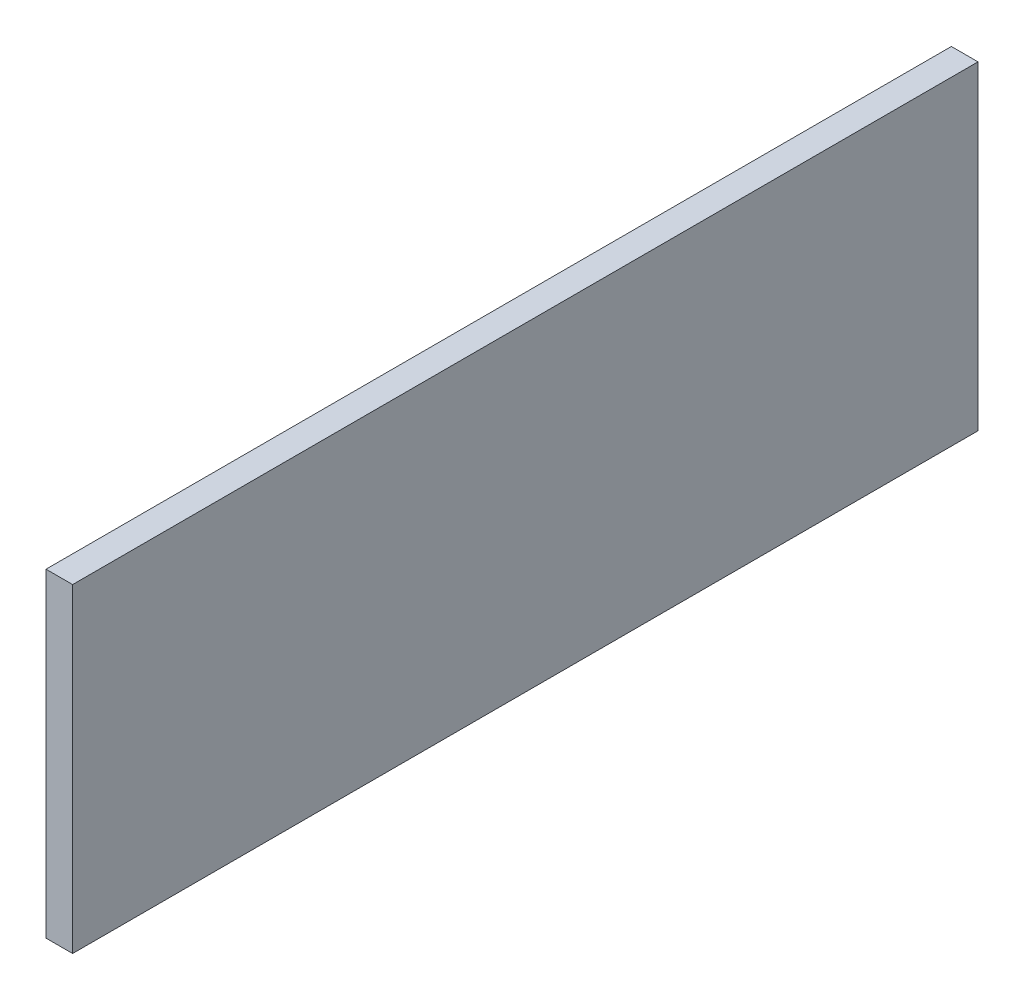
ISO-10303-21;
HEADER;
FILE_DESCRIPTION(('STEP AP214'),'2;1');
FILE_NAME('part.step','',(''),(''),'','','');
FILE_SCHEMA(('AUTOMOTIVE_DESIGN { 1 0 10303 214 1 1 1 1 }'));
ENDSEC;
DATA;
#1=APPLICATION_CONTEXT('core data for automotive mechanical design processes');
#2=APPLICATION_PROTOCOL_DEFINITION('international standard','automotive_design',2000,#1);
#3=PRODUCT_CONTEXT('',#1,'mechanical');
#4=PRODUCT('Part','Part','',(#3));
#5=PRODUCT_RELATED_PRODUCT_CATEGORY('part','',(#4));
#6=PRODUCT_DEFINITION_FORMATION('','',#4);
#7=PRODUCT_DEFINITION_CONTEXT('part definition',#1,'design');
#8=PRODUCT_DEFINITION('design','',#6,#7);
#9=PRODUCT_DEFINITION_SHAPE('','',#8);
#10=(LENGTH_UNIT() NAMED_UNIT(*) SI_UNIT(.MILLI.,.METRE.));
#11=(NAMED_UNIT(*) PLANE_ANGLE_UNIT() SI_UNIT($,.RADIAN.));
#12=(NAMED_UNIT(*) SI_UNIT($,.STERADIAN.) SOLID_ANGLE_UNIT());
#13=UNCERTAINTY_MEASURE_WITH_UNIT(LENGTH_MEASURE(1.E-05),#10,'distance_accuracy_value','');
#14=(GEOMETRIC_REPRESENTATION_CONTEXT(3) GLOBAL_UNCERTAINTY_ASSIGNED_CONTEXT((#13)) GLOBAL_UNIT_ASSIGNED_CONTEXT((#10,
#11,#12)) REPRESENTATION_CONTEXT('',''));
#15=CARTESIAN_POINT('',(0.,0.,0.));
#16=DIRECTION('',(0.,0.,1.));
#17=DIRECTION('',(1.,0.,0.));
#18=AXIS2_PLACEMENT_3D('',#15,#16,#17);
#19=CARTESIAN_POINT('',(19.05,0.,0.));
#20=DIRECTION('',(0.,0.,-1.));
#21=DIRECTION('',(0.,1.,0.));
#22=AXIS2_PLACEMENT_3D('',#19,#20,#21);
#23=PLANE('',#22);
#24=DIRECTION('',(0.,-1.,0.));
#25=VECTOR('',#24,1.);
#26=CARTESIAN_POINT('',(0.,0.,0.));
#27=LINE('',#26,#25);
#28=CARTESIAN_POINT('',(0.,0.,0.));
#29=VERTEX_POINT('',#28);
#30=CARTESIAN_POINT('',(0.,-228.6,0.));
#31=VERTEX_POINT('',#30);
#32=EDGE_CURVE('E98',#29,#31,#27,.T.);
#33=ORIENTED_EDGE('',*,*,#32,.T.);
#34=DIRECTION('',(-1.,0.,0.));
#35=VECTOR('',#34,1.);
#36=CARTESIAN_POINT('',(19.05,-228.6,0.));
#37=LINE('',#36,#35);
#38=CARTESIAN_POINT('',(19.05,-228.6,0.));
#39=VERTEX_POINT('',#38);
#40=EDGE_CURVE('E11',#39,#31,#37,.T.);
#41=ORIENTED_EDGE('',*,*,#40,.F.);
#42=DIRECTION('',(0.,-1.,0.));
#43=VECTOR('',#42,1.);
#44=CARTESIAN_POINT('',(19.05,0.,0.));
#45=LINE('',#44,#43);
#46=CARTESIAN_POINT('',(19.05,0.,0.));
#47=VERTEX_POINT('',#46);
#48=EDGE_CURVE('E86',#47,#39,#45,.T.);
#49=ORIENTED_EDGE('',*,*,#48,.F.);
#50=DIRECTION('',(-1.,0.,0.));
#51=VECTOR('',#50,1.);
#52=CARTESIAN_POINT('',(19.05,0.,0.));
#53=LINE('',#52,#51);
#54=EDGE_CURVE('E94',#47,#29,#53,.T.);
#55=ORIENTED_EDGE('',*,*,#54,.T.);
#56=EDGE_LOOP('',(#33,#41,#49,#55));
#57=FACE_BOUND('',#56,.T.);
#58=ADVANCED_FACE('F35',(#57),#23,.F.);
#59=CARTESIAN_POINT('',(19.05,-228.6,0.));
#60=DIRECTION('',(0.,1.,0.));
#61=DIRECTION('',(0.,0.,1.));
#62=AXIS2_PLACEMENT_3D('',#59,#60,#61);
#63=PLANE('',#62);
#64=DIRECTION('',(0.,0.,-1.));
#65=VECTOR('',#64,1.);
#66=CARTESIAN_POINT('',(0.,-228.6,0.));
#67=LINE('',#66,#65);
#68=CARTESIAN_POINT('',(0.,-228.6,-647.7));
#69=VERTEX_POINT('',#68);
#70=EDGE_CURVE('E90',#31,#69,#67,.T.);
#71=ORIENTED_EDGE('',*,*,#70,.T.);
#72=DIRECTION('',(-1.,0.,0.));
#73=VECTOR('',#72,1.);
#74=CARTESIAN_POINT('',(19.05,-228.6,-647.7));
#75=LINE('',#74,#73);
#76=CARTESIAN_POINT('',(19.05,-228.6,-647.7));
#77=VERTEX_POINT('',#76);
#78=EDGE_CURVE('E43',#77,#69,#75,.T.);
#79=ORIENTED_EDGE('',*,*,#78,.F.);
#80=DIRECTION('',(0.,0.,-1.));
#81=VECTOR('',#80,1.);
#82=CARTESIAN_POINT('',(19.05,-228.6,0.));
#83=LINE('',#82,#81);
#84=EDGE_CURVE('E81',#39,#77,#83,.T.);
#85=ORIENTED_EDGE('',*,*,#84,.F.);
#86=ORIENTED_EDGE('',*,*,#40,.T.);
#87=EDGE_LOOP('',(#71,#79,#85,#86));
#88=FACE_BOUND('',#87,.T.);
#89=ADVANCED_FACE('F89',(#88),#63,.F.);
#90=CARTESIAN_POINT('',(19.05,0.,-647.7));
#91=DIRECTION('',(0.,0.,1.));
#92=DIRECTION('',(1.,0.,0.));
#93=AXIS2_PLACEMENT_3D('',#90,#91,#92);
#94=PLANE('',#93);
#95=DIRECTION('',(0.,1.,0.));
#96=VECTOR('',#95,1.);
#97=CARTESIAN_POINT('',(0.,0.,-647.7));
#98=LINE('',#97,#96);
#99=CARTESIAN_POINT('',(0.,0.,-647.7));
#100=VERTEX_POINT('',#99);
#101=EDGE_CURVE('E68',#69,#100,#98,.T.);
#102=ORIENTED_EDGE('',*,*,#101,.T.);
#103=DIRECTION('',(-1.,0.,0.));
#104=VECTOR('',#103,1.);
#105=CARTESIAN_POINT('',(19.05,0.,-647.7));
#106=LINE('',#105,#104);
#107=CARTESIAN_POINT('',(19.05,0.,-647.7));
#108=VERTEX_POINT('',#107);
#109=EDGE_CURVE('E91',#108,#100,#106,.T.);
#110=ORIENTED_EDGE('',*,*,#109,.F.);
#111=DIRECTION('',(0.,1.,0.));
#112=VECTOR('',#111,1.);
#113=CARTESIAN_POINT('',(19.05,0.,-647.7));
#114=LINE('',#113,#112);
#115=EDGE_CURVE('E84',#77,#108,#114,.T.);
#116=ORIENTED_EDGE('',*,*,#115,.F.);
#117=ORIENTED_EDGE('',*,*,#78,.T.);
#118=EDGE_LOOP('',(#102,#110,#116,#117));
#119=FACE_BOUND('',#118,.T.);
#120=ADVANCED_FACE('F92',(#119),#94,.F.);
#121=CARTESIAN_POINT('',(19.05,0.,0.));
#122=DIRECTION('',(0.,-1.,0.));
#123=DIRECTION('',(0.,0.,-1.));
#124=AXIS2_PLACEMENT_3D('',#121,#122,#123);
#125=PLANE('',#124);
#126=DIRECTION('',(0.,0.,1.));
#127=VECTOR('',#126,1.);
#128=CARTESIAN_POINT('',(0.,0.,0.));
#129=LINE('',#128,#127);
#130=EDGE_CURVE('E74',#100,#29,#129,.T.);
#131=ORIENTED_EDGE('',*,*,#130,.T.);
#132=ORIENTED_EDGE('',*,*,#54,.F.);
#133=DIRECTION('',(0.,0.,1.));
#134=VECTOR('',#133,1.);
#135=CARTESIAN_POINT('',(19.05,0.,0.));
#136=LINE('',#135,#134);
#137=EDGE_CURVE('E51',#108,#47,#136,.T.);
#138=ORIENTED_EDGE('',*,*,#137,.F.);
#139=ORIENTED_EDGE('',*,*,#109,.T.);
#140=EDGE_LOOP('',(#131,#132,#138,#139));
#141=FACE_BOUND('',#140,.T.);
#142=ADVANCED_FACE('F105',(#141),#125,.F.);
#143=CARTESIAN_POINT('',(19.05,-228.6,0.));
#144=DIRECTION('',(1.,0.,0.));
#145=DIRECTION('',(0.,0.,-1.));
#146=AXIS2_PLACEMENT_3D('',#143,#144,#145);
#147=PLANE('',#146);
#148=ORIENTED_EDGE('',*,*,#48,.T.);
#149=ORIENTED_EDGE('',*,*,#84,.T.);
#150=ORIENTED_EDGE('',*,*,#115,.T.);
#151=ORIENTED_EDGE('',*,*,#137,.T.);
#152=EDGE_LOOP('',(#148,#149,#150,#151));
#153=FACE_BOUND('',#152,.T.);
#154=ADVANCED_FACE('F82',(#153),#147,.T.);
#155=CARTESIAN_POINT('',(0.,-228.6,0.));
#156=DIRECTION('',(1.,0.,0.));
#157=DIRECTION('',(0.,0.,-1.));
#158=AXIS2_PLACEMENT_3D('',#155,#156,#157);
#159=PLANE('',#158);
#160=ORIENTED_EDGE('',*,*,#32,.F.);
#161=ORIENTED_EDGE('',*,*,#130,.F.);
#162=ORIENTED_EDGE('',*,*,#101,.F.);
#163=ORIENTED_EDGE('',*,*,#70,.F.);
#164=EDGE_LOOP('',(#160,#161,#162,#163));
#165=FACE_BOUND('',#164,.T.);
#166=ADVANCED_FACE('F108',(#165),#159,.F.);
#167=CLOSED_SHELL('',(#58,#89,#120,#142,#154,#166));
#168=MANIFOLD_SOLID_BREP('B2',#167);
#169=ADVANCED_BREP_SHAPE_REPRESENTATION('',(#18,#168),#14);
#170=SHAPE_DEFINITION_REPRESENTATION(#9,#169);
ENDSEC;
END-ISO-10303-21;
